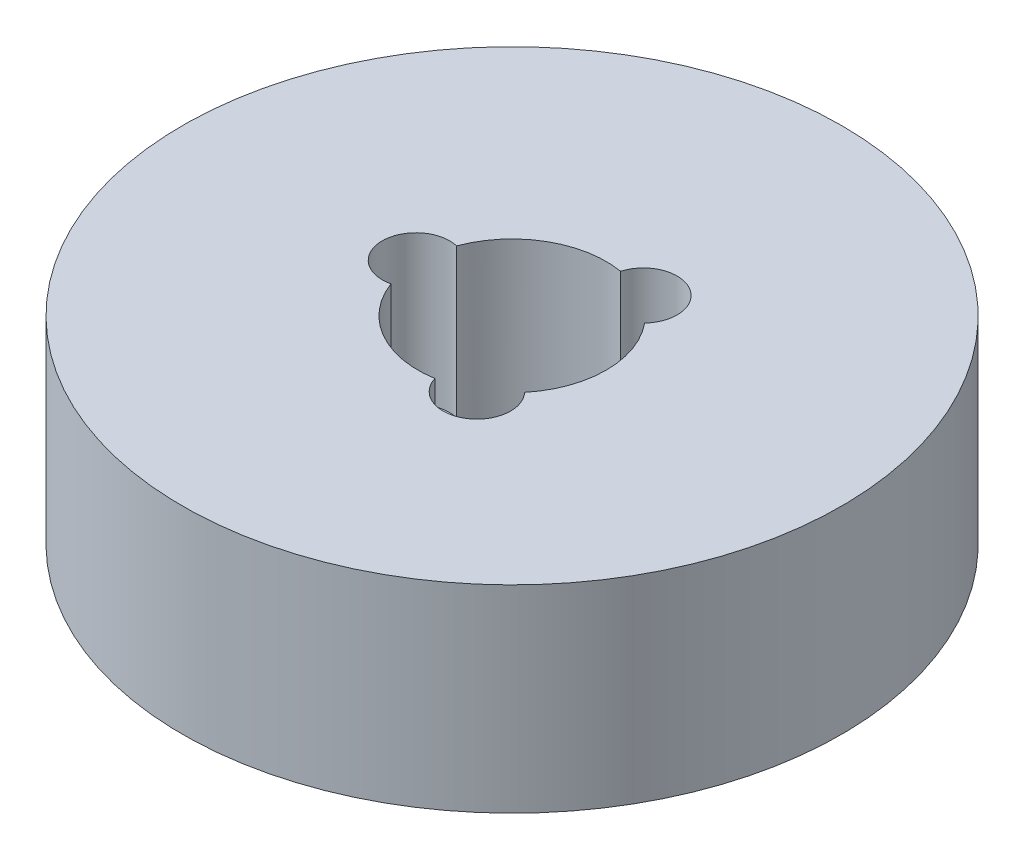
ISO-10303-21;
HEADER;
FILE_DESCRIPTION(('STEP AP214'),'2;1');
FILE_NAME('part.step','',(''),(''),'','','');
FILE_SCHEMA(('AUTOMOTIVE_DESIGN { 1 0 10303 214 1 1 1 1 }'));
ENDSEC;
DATA;
#1=APPLICATION_CONTEXT('core data for automotive mechanical design processes');
#2=APPLICATION_PROTOCOL_DEFINITION('international standard','automotive_design',2000,#1);
#3=PRODUCT_CONTEXT('',#1,'mechanical');
#4=PRODUCT('Part','Part','',(#3));
#5=PRODUCT_RELATED_PRODUCT_CATEGORY('part','',(#4));
#6=PRODUCT_DEFINITION_FORMATION('','',#4);
#7=PRODUCT_DEFINITION_CONTEXT('part definition',#1,'design');
#8=PRODUCT_DEFINITION('design','',#6,#7);
#9=PRODUCT_DEFINITION_SHAPE('','',#8);
#10=(LENGTH_UNIT() NAMED_UNIT(*) SI_UNIT(.MILLI.,.METRE.));
#11=(NAMED_UNIT(*) PLANE_ANGLE_UNIT() SI_UNIT($,.RADIAN.));
#12=(NAMED_UNIT(*) SI_UNIT($,.STERADIAN.) SOLID_ANGLE_UNIT());
#13=UNCERTAINTY_MEASURE_WITH_UNIT(LENGTH_MEASURE(1.E-05),#10,'distance_accuracy_value','');
#14=(GEOMETRIC_REPRESENTATION_CONTEXT(3) GLOBAL_UNCERTAINTY_ASSIGNED_CONTEXT((#13)) GLOBAL_UNIT_ASSIGNED_CONTEXT((#10,
#11,#12)) REPRESENTATION_CONTEXT('',''));
#15=CARTESIAN_POINT('',(0.,0.,0.));
#16=DIRECTION('',(0.,0.,1.));
#17=DIRECTION('',(1.,0.,0.));
#18=AXIS2_PLACEMENT_3D('',#15,#16,#17);
#19=CARTESIAN_POINT('',(0.,21.,0.));
#20=DIRECTION('',(0.,-1.,0.));
#21=DIRECTION('',(0.,0.,-1.));
#22=AXIS2_PLACEMENT_3D('',#19,#20,#21);
#23=CYLINDRICAL_SURFACE('',#22,35.);
#24=CARTESIAN_POINT('',(0.,21.,0.));
#25=DIRECTION('',(0.,1.,0.));
#26=DIRECTION('',(0.,0.,1.));
#27=AXIS2_PLACEMENT_3D('',#24,#25,#26);
#28=CIRCLE('',#27,35.);
#29=CARTESIAN_POINT('',(0.,21.,-35.));
#30=VERTEX_POINT('',#29);
#31=EDGE_CURVE('E126',#30,#30,#28,.T.);
#32=CARTESIAN_POINT('',(0.,0.,0.));
#33=DIRECTION('',(0.,1.,0.));
#34=DIRECTION('',(0.,0.,1.));
#35=AXIS2_PLACEMENT_3D('',#32,#33,#34);
#36=CIRCLE('',#35,35.);
#37=CARTESIAN_POINT('',(0.,0.,-35.));
#38=VERTEX_POINT('',#37);
#39=EDGE_CURVE('E124',#38,#38,#36,.T.);
#40=CARTESIAN_POINT('',(0.,21.,-35.));
#41=CARTESIAN_POINT('',(0.,20.78125,-35.));
#42=CARTESIAN_POINT('',(0.,20.5625,-35.));
#43=CARTESIAN_POINT('',(0.,20.125,-35.));
#44=CARTESIAN_POINT('',(0.,19.90625,-35.));
#45=CARTESIAN_POINT('',(0.,19.46875,-35.));
#46=CARTESIAN_POINT('',(0.,19.25,-35.));
#47=CARTESIAN_POINT('',(0.,18.8125,-35.));
#48=CARTESIAN_POINT('',(0.,18.59375,-35.));
#49=CARTESIAN_POINT('',(0.,18.15625,-35.));
#50=CARTESIAN_POINT('',(0.,17.9375,-35.));
#51=CARTESIAN_POINT('',(0.,17.5,-35.));
#52=CARTESIAN_POINT('',(0.,17.28125,-35.));
#53=CARTESIAN_POINT('',(0.,16.84375,-35.));
#54=CARTESIAN_POINT('',(0.,16.625,-35.));
#55=CARTESIAN_POINT('',(0.,16.1875,-35.));
#56=CARTESIAN_POINT('',(0.,15.96875,-35.));
#57=CARTESIAN_POINT('',(0.,15.53125,-35.));
#58=CARTESIAN_POINT('',(0.,15.3125,-35.));
#59=CARTESIAN_POINT('',(0.,14.875,-35.));
#60=CARTESIAN_POINT('',(0.,14.65625,-35.));
#61=CARTESIAN_POINT('',(0.,14.21875,-35.));
#62=CARTESIAN_POINT('',(0.,14.,-35.));
#63=CARTESIAN_POINT('',(0.,13.5625,-35.));
#64=CARTESIAN_POINT('',(0.,13.34375,-35.));
#65=CARTESIAN_POINT('',(0.,12.90625,-35.));
#66=CARTESIAN_POINT('',(0.,12.6875,-35.));
#67=CARTESIAN_POINT('',(0.,12.25,-35.));
#68=CARTESIAN_POINT('',(0.,12.03125,-35.));
#69=CARTESIAN_POINT('',(0.,11.59375,-35.));
#70=CARTESIAN_POINT('',(0.,11.375,-35.));
#71=CARTESIAN_POINT('',(0.,10.9375,-35.));
#72=CARTESIAN_POINT('',(0.,10.71875,-35.));
#73=CARTESIAN_POINT('',(0.,10.28125,-35.));
#74=CARTESIAN_POINT('',(0.,10.0625,-35.));
#75=CARTESIAN_POINT('',(0.,9.625,-35.));
#76=CARTESIAN_POINT('',(0.,9.40625,-35.));
#77=CARTESIAN_POINT('',(0.,8.96875,-35.));
#78=CARTESIAN_POINT('',(0.,8.75,-35.));
#79=CARTESIAN_POINT('',(0.,8.3125,-35.));
#80=CARTESIAN_POINT('',(0.,8.09375,-35.));
#81=CARTESIAN_POINT('',(0.,7.65625,-35.));
#82=CARTESIAN_POINT('',(0.,7.4375,-35.));
#83=CARTESIAN_POINT('',(0.,7.,-35.));
#84=CARTESIAN_POINT('',(0.,6.78125,-35.));
#85=CARTESIAN_POINT('',(0.,6.34375,-35.));
#86=CARTESIAN_POINT('',(0.,6.125,-35.));
#87=CARTESIAN_POINT('',(0.,5.6875,-35.));
#88=CARTESIAN_POINT('',(0.,5.46875,-35.));
#89=CARTESIAN_POINT('',(0.,5.03125,-35.));
#90=CARTESIAN_POINT('',(0.,4.8125,-35.));
#91=CARTESIAN_POINT('',(0.,4.375,-35.));
#92=CARTESIAN_POINT('',(0.,4.15625,-35.));
#93=CARTESIAN_POINT('',(0.,3.71875,-35.));
#94=CARTESIAN_POINT('',(0.,3.5,-35.));
#95=CARTESIAN_POINT('',(0.,3.0625,-35.));
#96=CARTESIAN_POINT('',(0.,2.84375,-35.));
#97=CARTESIAN_POINT('',(0.,2.40625,-35.));
#98=CARTESIAN_POINT('',(0.,2.1875,-35.));
#99=CARTESIAN_POINT('',(0.,1.75,-35.));
#100=CARTESIAN_POINT('',(0.,1.53125,-35.));
#101=CARTESIAN_POINT('',(0.,1.09375,-35.));
#102=CARTESIAN_POINT('',(0.,0.875000000000001,-35.));
#103=CARTESIAN_POINT('',(0.,0.4375,-35.));
#104=CARTESIAN_POINT('',(0.,0.21875,-35.));
#105=CARTESIAN_POINT('',(0.,0.,-35.));
#106=B_SPLINE_CURVE_WITH_KNOTS('',3,(#40,#41,#42,#43,#44,#45,#46,#47,#48,#49,#50,#51,#52,#53,
#54,#55,#56,#57,#58,#59,#60,#61,#62,#63,#64,#65,#66,#67,#68,#69,#70,#71,#72,#73,#74,#75,#76,#77,
#78,#79,#80,#81,#82,#83,#84,#85,#86,#87,#88,#89,#90,#91,#92,#93,#94,#95,#96,#97,#98,#99,#100,
#101,#102,#103,#104,#105),.UNSPECIFIED.,.F.,.F.,(4,2,2,2,2,2,2,2,2,2,2,2,2,2,2,2,2,2,2,2,2,2,2,
2,2,2,2,2,2,2,2,2,4),(0.,0.656250000000001,1.3125,1.96875,2.625,3.28125,3.9375,4.59375,5.25,
5.90625,6.5625,7.21875,7.875,8.53125,9.1875,9.84375,10.5,11.15625,11.8125,12.46875,13.125,
13.78125,14.4375,15.09375,15.75,16.40625,17.0625,17.71875,18.375,19.03125,19.6875,20.34375,21.),.UNSPECIFIED.);
#107=EDGE_CURVE('BSEAM39',#30,#38,#106,.T.);
#108=ORIENTED_EDGE('',*,*,#31,.F.);
#109=ORIENTED_EDGE('',*,*,#39,.T.);
#110=ORIENTED_EDGE('',*,*,#107,.T.);
#111=ORIENTED_EDGE('',*,*,#107,.F.);
#112=EDGE_LOOP('',(#108,#110,#109,#111));
#113=FACE_BOUND('',#112,.T.);
#114=ADVANCED_FACE('F39',(#113),#23,.T.);
#115=CARTESIAN_POINT('',(0.,21.,0.));
#116=DIRECTION('',(0.,1.,0.));
#117=DIRECTION('',(0.,0.,1.));
#118=AXIS2_PLACEMENT_3D('',#115,#116,#117);
#119=PLANE('',#118);
#120=CARTESIAN_POINT('',(5.1036735970566,21.,8.83982197534975));
#121=DIRECTION('',(0.,1.,0.));
#122=DIRECTION('',(0.866025403784436,0.,-0.500000000000004));
#123=AXIS2_PLACEMENT_3D('',#120,#121,#122);
#124=CIRCLE('',#123,3.58635036243125);
#125=CARTESIAN_POINT('',(1.66557832701015,21.,9.86031687303172));
#126=VERTEX_POINT('',#125);
#127=CARTESIAN_POINT('',(7.7064957379048,21.,6.37259157969936));
#128=VERTEX_POINT('',#127);
#129=EDGE_CURVE('E147',#126,#128,#124,.T.);
#130=ORIENTED_EDGE('',*,*,#129,.F.);
#131=CARTESIAN_POINT('',(0.,21.,0.));
#132=DIRECTION('',(0.,1.,0.));
#133=DIRECTION('',(0.,0.,1.));
#134=AXIS2_PLACEMENT_3D('',#131,#132,#133);
#135=CIRCLE('',#134,10.);
#136=CARTESIAN_POINT('',(-9.37207406491487,21.,3.48772529333233));
#137=VERTEX_POINT('',#136);
#138=EDGE_CURVE('E118',#137,#126,#135,.T.);
#139=ORIENTED_EDGE('',*,*,#138,.F.);
#140=CARTESIAN_POINT('',(-10.2073471941131,21.,0.));
#141=DIRECTION('',(0.,1.,0.));
#142=DIRECTION('',(0.,0.,1.));
#143=AXIS2_PLACEMENT_3D('',#140,#141,#142);
#144=CIRCLE('',#143,3.58635036243125);
#145=CARTESIAN_POINT('',(-9.37207406491487,21.,-3.48772529333233));
#146=VERTEX_POINT('',#145);
#147=EDGE_CURVE('E113',#146,#137,#144,.T.);
#148=ORIENTED_EDGE('',*,*,#147,.F.);
#149=CARTESIAN_POINT('',(1.66557832701001,21.,-9.86031687303175));
#150=VERTEX_POINT('',#149);
#151=EDGE_CURVE('E106',#150,#146,#135,.T.);
#152=ORIENTED_EDGE('',*,*,#151,.F.);
#153=CARTESIAN_POINT('',(5.10367359705648,21.,-8.83982197534982));
#154=DIRECTION('',(0.,1.,0.));
#155=DIRECTION('',(-0.866025403784443,0.,-0.499999999999992));
#156=AXIS2_PLACEMENT_3D('',#153,#154,#155);
#157=CIRCLE('',#156,3.58635036243125);
#158=CARTESIAN_POINT('',(7.70649573790471,21.,-6.37259157969947));
#159=VERTEX_POINT('',#158);
#160=EDGE_CURVE('E90',#159,#150,#157,.T.);
#161=ORIENTED_EDGE('',*,*,#160,.F.);
#162=EDGE_CURVE('E116',#128,#159,#135,.T.);
#163=ORIENTED_EDGE('',*,*,#162,.F.);
#164=EDGE_LOOP('',(#130,#139,#148,#152,#161,#163));
#165=FACE_BOUND('',#164,.T.);
#166=ORIENTED_EDGE('',*,*,#31,.T.);
#167=EDGE_LOOP('',(#166));
#168=FACE_BOUND('',#167,.T.);
#169=ADVANCED_FACE('F115',(#165,#168),#119,.T.);
#170=CARTESIAN_POINT('',(0.,0.,0.));
#171=DIRECTION('',(0.,1.,0.));
#172=DIRECTION('',(0.,0.,1.));
#173=AXIS2_PLACEMENT_3D('',#170,#171,#172);
#174=PLANE('',#173);
#175=CARTESIAN_POINT('',(0.,0.,0.));
#176=DIRECTION('',(0.,1.,0.));
#177=DIRECTION('',(0.,0.,1.));
#178=AXIS2_PLACEMENT_3D('',#175,#176,#177);
#179=CIRCLE('',#178,10.);
#180=CARTESIAN_POINT('',(0.,0.,10.));
#181=VERTEX_POINT('',#180);
#182=EDGE_CURVE('E120',#181,#181,#179,.T.);
#183=ORIENTED_EDGE('',*,*,#182,.T.);
#184=EDGE_LOOP('',(#183));
#185=FACE_BOUND('',#184,.T.);
#186=ORIENTED_EDGE('',*,*,#39,.F.);
#187=EDGE_LOOP('',(#186));
#188=FACE_BOUND('',#187,.T.);
#189=ADVANCED_FACE('F164',(#185,#188),#174,.F.);
#190=CARTESIAN_POINT('',(0.,21.,0.));
#191=DIRECTION('',(0.,-1.,0.));
#192=DIRECTION('',(0.,0.,-1.));
#193=AXIS2_PLACEMENT_3D('',#190,#191,#192);
#194=CYLINDRICAL_SURFACE('',#193,10.);
#195=DIRECTION('',(0.,1.,0.));
#196=VECTOR('',#195,1.);
#197=CARTESIAN_POINT('',(1.66557832701015,13.1012765567641,9.86031687303172));
#198=LINE('',#197,#196);
#199=CARTESIAN_POINT('',(1.66557832701015,5.20255311352829,9.86031687303172));
#200=VERTEX_POINT('',#199);
#201=EDGE_CURVE('E11',#200,#126,#198,.T.);
#202=ORIENTED_EDGE('',*,*,#201,.F.);
#203=CARTESIAN_POINT('',(0.,5.20255311352829,0.));
#204=DIRECTION('',(0.,1.,0.));
#205=DIRECTION('',(0.,0.,1.));
#206=AXIS2_PLACEMENT_3D('',#203,#204,#205);
#207=CIRCLE('',#206,10.);
#208=CARTESIAN_POINT('',(7.7064957379048,5.20255311352829,6.37259157969936));
#209=VERTEX_POINT('',#208);
#210=EDGE_CURVE('E144',#200,#209,#207,.T.);
#211=ORIENTED_EDGE('',*,*,#210,.T.);
#212=DIRECTION('',(0.,1.,0.));
#213=VECTOR('',#212,1.);
#214=CARTESIAN_POINT('',(7.7064957379048,13.1012765567641,6.37259157969936));
#215=LINE('',#214,#213);
#216=EDGE_CURVE('E46',#128,#209,#215,.F.);
#217=ORIENTED_EDGE('',*,*,#216,.F.);
#218=ORIENTED_EDGE('',*,*,#162,.T.);
#219=DIRECTION('',(0.,1.,0.));
#220=VECTOR('',#219,1.);
#221=CARTESIAN_POINT('',(7.70649573790471,13.1012765567641,-6.37259157969947));
#222=LINE('',#221,#220);
#223=CARTESIAN_POINT('',(7.70649573790471,5.20255311352829,-6.37259157969947));
#224=VERTEX_POINT('',#223);
#225=EDGE_CURVE('E92',#224,#159,#222,.T.);
#226=ORIENTED_EDGE('',*,*,#225,.F.);
#227=CARTESIAN_POINT('',(0.,5.20255311352829,0.));
#228=DIRECTION('',(0.,1.,0.));
#229=DIRECTION('',(0.,0.,1.));
#230=AXIS2_PLACEMENT_3D('',#227,#228,#229);
#231=CIRCLE('',#230,10.);
#232=CARTESIAN_POINT('',(1.66557832701001,5.20255311352829,-9.86031687303175));
#233=VERTEX_POINT('',#232);
#234=EDGE_CURVE('E107',#224,#233,#231,.T.);
#235=ORIENTED_EDGE('',*,*,#234,.T.);
#236=DIRECTION('',(0.,1.,0.));
#237=VECTOR('',#236,1.);
#238=CARTESIAN_POINT('',(1.66557832701001,13.1012765567641,-9.86031687303175));
#239=LINE('',#238,#237);
#240=EDGE_CURVE('E95',#150,#233,#239,.F.);
#241=ORIENTED_EDGE('',*,*,#240,.F.);
#242=ORIENTED_EDGE('',*,*,#151,.T.);
#243=DIRECTION('',(0.,1.,0.));
#244=VECTOR('',#243,1.);
#245=CARTESIAN_POINT('',(-9.37207406491487,13.1012765567641,-3.48772529333233));
#246=LINE('',#245,#244);
#247=CARTESIAN_POINT('',(-9.37207406491487,5.20255311352829,-3.48772529333233));
#248=VERTEX_POINT('',#247);
#249=EDGE_CURVE('E143',#248,#146,#246,.T.);
#250=ORIENTED_EDGE('',*,*,#249,.F.);
#251=CARTESIAN_POINT('',(0.,5.20255311352829,0.));
#252=DIRECTION('',(0.,1.,0.));
#253=DIRECTION('',(0.,0.,1.));
#254=AXIS2_PLACEMENT_3D('',#251,#252,#253);
#255=CIRCLE('',#254,10.);
#256=CARTESIAN_POINT('',(-9.37207406491487,5.20255311352829,3.48772529333233));
#257=VERTEX_POINT('',#256);
#258=EDGE_CURVE('E132',#248,#257,#255,.T.);
#259=ORIENTED_EDGE('',*,*,#258,.T.);
#260=DIRECTION('',(0.,1.,0.));
#261=VECTOR('',#260,1.);
#262=CARTESIAN_POINT('',(-9.37207406491487,13.1012765567641,3.48772529333233));
#263=LINE('',#262,#261);
#264=EDGE_CURVE('E137',#137,#257,#263,.F.);
#265=ORIENTED_EDGE('',*,*,#264,.F.);
#266=ORIENTED_EDGE('',*,*,#138,.T.);
#267=EDGE_LOOP('',(#202,#211,#217,#218,#226,#235,#241,#242,#250,#259,#265,#266));
#268=FACE_BOUND('',#267,.T.);
#269=ORIENTED_EDGE('',*,*,#182,.F.);
#270=EDGE_LOOP('',(#269));
#271=FACE_BOUND('',#270,.T.);
#272=ADVANCED_FACE('F103',(#268,#271),#194,.F.);
#273=CARTESIAN_POINT('',(-10.2073471941131,5.20255311352829,0.));
#274=DIRECTION('',(0.,1.,0.));
#275=DIRECTION('',(0.,0.,1.));
#276=AXIS2_PLACEMENT_3D('',#273,#274,#275);
#277=CYLINDRICAL_SURFACE('',#276,3.58635036243125);
#278=ORIENTED_EDGE('',*,*,#249,.T.);
#279=ORIENTED_EDGE('',*,*,#147,.T.);
#280=ORIENTED_EDGE('',*,*,#264,.T.);
#281=CARTESIAN_POINT('',(-10.2073471941131,5.20255311352829,0.));
#282=DIRECTION('',(0.,1.,0.));
#283=DIRECTION('',(0.,0.,1.));
#284=AXIS2_PLACEMENT_3D('',#281,#282,#283);
#285=CIRCLE('',#284,3.58635036243125);
#286=EDGE_CURVE('E121',#248,#257,#285,.T.);
#287=ORIENTED_EDGE('',*,*,#286,.F.);
#288=EDGE_LOOP('',(#278,#279,#280,#287));
#289=FACE_BOUND('',#288,.T.);
#290=ADVANCED_FACE('F174',(#289),#277,.F.);
#291=CARTESIAN_POINT('',(-10.2073471941131,5.20255311352829,0.));
#292=DIRECTION('',(0.,1.,0.));
#293=DIRECTION('',(0.,0.,1.));
#294=AXIS2_PLACEMENT_3D('',#291,#292,#293);
#295=PLANE('',#294);
#296=ORIENTED_EDGE('',*,*,#286,.T.);
#297=ORIENTED_EDGE('',*,*,#258,.F.);
#298=EDGE_LOOP('',(#296,#297));
#299=FACE_BOUND('',#298,.T.);
#300=ADVANCED_FACE('F177',(#299),#295,.T.);
#301=CARTESIAN_POINT('',(5.10367359705648,5.20255311352829,-8.83982197534982));
#302=DIRECTION('',(0.,1.,0.));
#303=DIRECTION('',(0.,0.,1.));
#304=AXIS2_PLACEMENT_3D('',#301,#302,#303);
#305=CYLINDRICAL_SURFACE('',#304,3.58635036243125);
#306=ORIENTED_EDGE('',*,*,#225,.T.);
#307=ORIENTED_EDGE('',*,*,#160,.T.);
#308=ORIENTED_EDGE('',*,*,#240,.T.);
#309=CARTESIAN_POINT('',(5.10367359705648,5.20255311352829,-8.83982197534982));
#310=DIRECTION('',(0.,1.,0.));
#311=DIRECTION('',(-0.866025403784443,0.,-0.499999999999992));
#312=AXIS2_PLACEMENT_3D('',#309,#310,#311);
#313=CIRCLE('',#312,3.58635036243125);
#314=EDGE_CURVE('E56',#224,#233,#313,.T.);
#315=ORIENTED_EDGE('',*,*,#314,.F.);
#316=EDGE_LOOP('',(#306,#307,#308,#315));
#317=FACE_BOUND('',#316,.T.);
#318=ADVANCED_FACE('F93',(#317),#305,.F.);
#319=CARTESIAN_POINT('',(5.10367359705648,5.20255311352829,-8.83982197534982));
#320=DIRECTION('',(0.,1.,0.));
#321=DIRECTION('',(-0.866025403784443,0.,-0.499999999999992));
#322=AXIS2_PLACEMENT_3D('',#319,#320,#321);
#323=PLANE('',#322);
#324=ORIENTED_EDGE('',*,*,#314,.T.);
#325=ORIENTED_EDGE('',*,*,#234,.F.);
#326=EDGE_LOOP('',(#324,#325));
#327=FACE_BOUND('',#326,.T.);
#328=ADVANCED_FACE('F160',(#327),#323,.T.);
#329=CARTESIAN_POINT('',(5.1036735970566,5.20255311352829,8.83982197534975));
#330=DIRECTION('',(0.,1.,0.));
#331=DIRECTION('',(0.,0.,1.));
#332=AXIS2_PLACEMENT_3D('',#329,#330,#331);
#333=CYLINDRICAL_SURFACE('',#332,3.58635036243125);
#334=ORIENTED_EDGE('',*,*,#201,.T.);
#335=ORIENTED_EDGE('',*,*,#129,.T.);
#336=ORIENTED_EDGE('',*,*,#216,.T.);
#337=CARTESIAN_POINT('',(5.1036735970566,5.20255311352829,8.83982197534975));
#338=DIRECTION('',(0.,1.,0.));
#339=DIRECTION('',(0.866025403784436,0.,-0.500000000000004));
#340=AXIS2_PLACEMENT_3D('',#337,#338,#339);
#341=CIRCLE('',#340,3.58635036243125);
#342=EDGE_CURVE('E55',#200,#209,#341,.T.);
#343=ORIENTED_EDGE('',*,*,#342,.F.);
#344=EDGE_LOOP('',(#334,#335,#336,#343));
#345=FACE_BOUND('',#344,.T.);
#346=ADVANCED_FACE('F149',(#345),#333,.F.);
#347=CARTESIAN_POINT('',(5.1036735970566,5.20255311352829,8.83982197534975));
#348=DIRECTION('',(0.,1.,0.));
#349=DIRECTION('',(0.866025403784436,0.,-0.500000000000004));
#350=AXIS2_PLACEMENT_3D('',#347,#348,#349);
#351=PLANE('',#350);
#352=ORIENTED_EDGE('',*,*,#342,.T.);
#353=ORIENTED_EDGE('',*,*,#210,.F.);
#354=EDGE_LOOP('',(#352,#353));
#355=FACE_BOUND('',#354,.T.);
#356=ADVANCED_FACE('F151',(#355),#351,.T.);
#357=CLOSED_SHELL('',(#114,#169,#189,#272,#290,#300,#318,#328,#346,#356));
#358=MANIFOLD_SOLID_BREP('B2',#357);
#359=ADVANCED_BREP_SHAPE_REPRESENTATION('',(#18,#358),#14);
#360=SHAPE_DEFINITION_REPRESENTATION(#9,#359);
ENDSEC;
END-ISO-10303-21;
